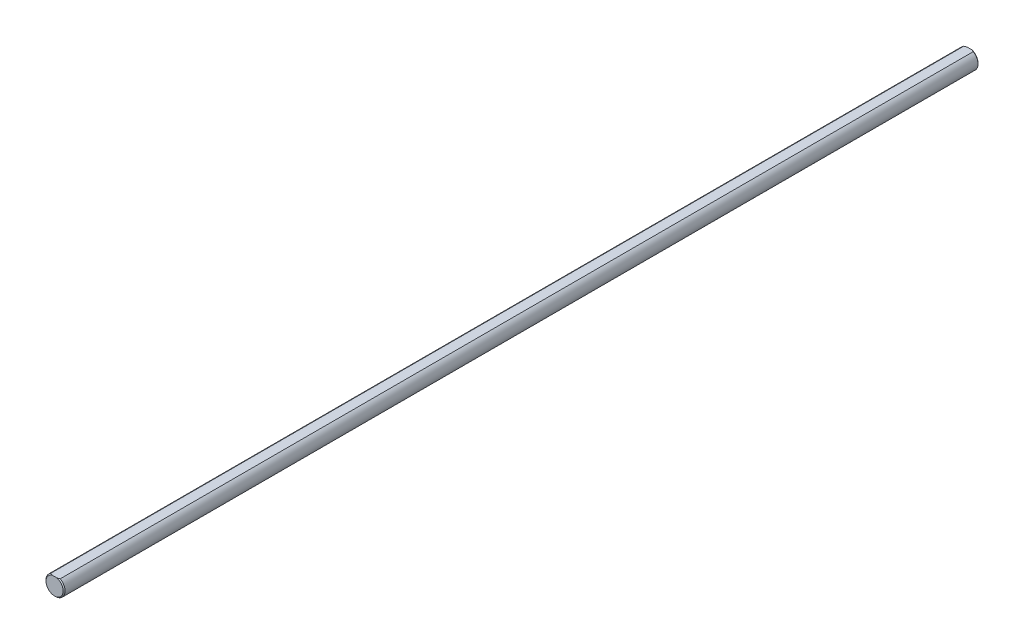
ISO-10303-21;
HEADER;
FILE_DESCRIPTION(('STEP AP214'),'2;1');
FILE_NAME('part.step','',(''),(''),'','','');
FILE_SCHEMA(('AUTOMOTIVE_DESIGN { 1 0 10303 214 1 1 1 1 }'));
ENDSEC;
DATA;
#1=APPLICATION_CONTEXT('core data for automotive mechanical design processes');
#2=APPLICATION_PROTOCOL_DEFINITION('international standard','automotive_design',2000,#1);
#3=PRODUCT_CONTEXT('',#1,'mechanical');
#4=PRODUCT('Part','Part','',(#3));
#5=PRODUCT_RELATED_PRODUCT_CATEGORY('part','',(#4));
#6=PRODUCT_DEFINITION_FORMATION('','',#4);
#7=PRODUCT_DEFINITION_CONTEXT('part definition',#1,'design');
#8=PRODUCT_DEFINITION('design','',#6,#7);
#9=PRODUCT_DEFINITION_SHAPE('','',#8);
#10=(LENGTH_UNIT() NAMED_UNIT(*) SI_UNIT(.MILLI.,.METRE.));
#11=(NAMED_UNIT(*) PLANE_ANGLE_UNIT() SI_UNIT($,.RADIAN.));
#12=(NAMED_UNIT(*) SI_UNIT($,.STERADIAN.) SOLID_ANGLE_UNIT());
#13=UNCERTAINTY_MEASURE_WITH_UNIT(LENGTH_MEASURE(1.E-05),#10,'distance_accuracy_value','');
#14=(GEOMETRIC_REPRESENTATION_CONTEXT(3) GLOBAL_UNCERTAINTY_ASSIGNED_CONTEXT((#13)) GLOBAL_UNIT_ASSIGNED_CONTEXT((#10,
#11,#12)) REPRESENTATION_CONTEXT('',''));
#15=CARTESIAN_POINT('',(0.,0.,0.));
#16=DIRECTION('',(0.,0.,1.));
#17=DIRECTION('',(1.,0.,0.));
#18=AXIS2_PLACEMENT_3D('',#15,#16,#17);
#19=CARTESIAN_POINT('',(0.,0.,152.4));
#20=DIRECTION('',(0.,0.,-1.));
#21=DIRECTION('',(-1.,0.,0.));
#22=AXIS2_PLACEMENT_3D('',#19,#20,#21);
#23=CYLINDRICAL_SURFACE('',#22,3.175);
#24=DIRECTION('',(0.,0.,1.));
#25=VECTOR('',#24,1.);
#26=CARTESIAN_POINT('',(-1.5875,2.74963065701559,-152.4));
#27=LINE('',#26,#25);
#28=CARTESIAN_POINT('',(-1.5875,2.74963065701559,-152.0825));
#29=VERTEX_POINT('',#28);
#30=CARTESIAN_POINT('',(-1.5875,2.74963065701559,152.0825));
#31=VERTEX_POINT('',#30);
#32=EDGE_CURVE('E81',#29,#31,#27,.T.);
#33=ORIENTED_EDGE('',*,*,#32,.F.);
#34=CARTESIAN_POINT('',(0.,0.,-152.0825));
#35=DIRECTION('',(0.,0.,1.));
#36=DIRECTION('',(1.,0.,0.));
#37=AXIS2_PLACEMENT_3D('',#34,#35,#36);
#38=CIRCLE('',#37,3.175);
#39=CARTESIAN_POINT('',(1.5875,2.74963065701559,-152.0825));
#40=VERTEX_POINT('',#39);
#41=EDGE_CURVE('E92',#29,#40,#38,.T.);
#42=ORIENTED_EDGE('',*,*,#41,.T.);
#43=DIRECTION('',(0.,0.,1.));
#44=VECTOR('',#43,1.);
#45=CARTESIAN_POINT('',(1.5875,2.74963065701559,-152.4));
#46=LINE('',#45,#44);
#47=CARTESIAN_POINT('',(1.5875,2.74963065701559,152.0825));
#48=VERTEX_POINT('',#47);
#49=EDGE_CURVE('E94',#40,#48,#46,.T.);
#50=ORIENTED_EDGE('',*,*,#49,.T.);
#51=CARTESIAN_POINT('',(0.,0.,152.0825));
#52=DIRECTION('',(0.,0.,1.));
#53=DIRECTION('',(1.,0.,0.));
#54=AXIS2_PLACEMENT_3D('',#51,#52,#53);
#55=CIRCLE('',#54,3.175);
#56=EDGE_CURVE('E93',#48,#31,#55,.F.);
#57=ORIENTED_EDGE('',*,*,#56,.T.);
#58=EDGE_LOOP('',(#33,#42,#50,#57));
#59=FACE_BOUND('',#58,.T.);
#60=ADVANCED_FACE('F34',(#59),#23,.T.);
#61=CARTESIAN_POINT('',(0.,0.,152.4));
#62=DIRECTION('',(0.,0.,1.));
#63=DIRECTION('',(1.,0.,0.));
#64=AXIS2_PLACEMENT_3D('',#61,#62,#63);
#65=PLANE('',#64);
#66=DIRECTION('',(1.,0.,0.));
#67=VECTOR('',#66,1.);
#68=CARTESIAN_POINT('',(-1.5875,2.74963065701559,152.4));
#69=LINE('',#68,#67);
#70=CARTESIAN_POINT('',(-0.777712993334318,2.74963065701559,152.4));
#71=VERTEX_POINT('',#70);
#72=CARTESIAN_POINT('',(0.777712993334318,2.74963065701559,152.4));
#73=VERTEX_POINT('',#72);
#74=EDGE_CURVE('E139',#71,#73,#69,.T.);
#75=ORIENTED_EDGE('',*,*,#74,.F.);
#76=CARTESIAN_POINT('',(0.,0.,152.4));
#77=DIRECTION('',(0.,0.,1.));
#78=DIRECTION('',(1.,0.,0.));
#79=AXIS2_PLACEMENT_3D('',#76,#77,#78);
#80=CIRCLE('',#79,2.85750000000018);
#81=EDGE_CURVE('E11',#71,#73,#80,.T.);
#82=ORIENTED_EDGE('',*,*,#81,.T.);
#83=EDGE_LOOP('',(#75,#82));
#84=FACE_BOUND('',#83,.T.);
#85=ADVANCED_FACE('F132',(#84),#65,.T.);
#86=CARTESIAN_POINT('',(0.,0.,-152.4));
#87=DIRECTION('',(0.,0.,1.));
#88=DIRECTION('',(1.,0.,0.));
#89=AXIS2_PLACEMENT_3D('',#86,#87,#88);
#90=PLANE('',#89);
#91=DIRECTION('',(1.,0.,0.));
#92=VECTOR('',#91,1.);
#93=CARTESIAN_POINT('',(-1.5875,2.74963065701559,-152.4));
#94=LINE('',#93,#92);
#95=CARTESIAN_POINT('',(-0.77771299333289,2.74963065701559,-152.4));
#96=VERTEX_POINT('',#95);
#97=CARTESIAN_POINT('',(0.77771299333289,2.74963065701559,-152.4));
#98=VERTEX_POINT('',#97);
#99=EDGE_CURVE('E83',#96,#98,#94,.T.);
#100=ORIENTED_EDGE('',*,*,#99,.T.);
#101=CARTESIAN_POINT('',(0.,0.,-152.4));
#102=DIRECTION('',(0.,0.,1.));
#103=DIRECTION('',(1.,0.,0.));
#104=AXIS2_PLACEMENT_3D('',#101,#102,#103);
#105=CIRCLE('',#104,2.85749999999979);
#106=EDGE_CURVE('E43',#98,#96,#105,.F.);
#107=ORIENTED_EDGE('',*,*,#106,.T.);
#108=EDGE_LOOP('',(#100,#107));
#109=FACE_BOUND('',#108,.T.);
#110=ADVANCED_FACE('F113',(#109),#90,.F.);
#111=CARTESIAN_POINT('',(-1.5875,2.74963065701559,-152.4));
#112=DIRECTION('',(0.,-1.,0.));
#113=DIRECTION('',(0.,0.,-1.));
#114=AXIS2_PLACEMENT_3D('',#111,#112,#113);
#115=PLANE('',#114);
#116=ORIENTED_EDGE('',*,*,#49,.F.);
#117=CARTESIAN_POINT('',(1.5875,2.74963065701559,-152.0825));
#118=CARTESIAN_POINT('',(1.52250516699264,2.74963065701559,-152.11498808248));
#119=CARTESIAN_POINT('',(1.45690188238018,2.74963065701559,-152.146301907619));
#120=CARTESIAN_POINT('',(1.32458227076998,2.74963065701559,-152.206025851425));
#121=CARTESIAN_POINT('',(1.25786903887703,2.74963065701559,-152.234442847017));
#122=CARTESIAN_POINT('',(1.12308918002454,2.74963065701559,-152.287992005704));
#123=CARTESIAN_POINT('',(1.05502199036127,2.74963065701559,-152.313122768734));
#124=CARTESIAN_POINT('',(0.917422256787349,2.74963065701559,-152.359582195948));
#125=CARTESIAN_POINT('',(0.847886543274815,2.74963065701559,-152.380901435531));
#126=CARTESIAN_POINT('',(0.777712993332883,2.74963065701559,-152.4));
#127=B_SPLINE_CURVE_WITH_KNOTS('',3,(#117,#118,#119,#120,#121,#122,#123,#124,#125,#126),
.UNSPECIFIED.,.F.,.F.,(4,2,2,2,4),(0.,0.218002568777972,0.435474929897561,0.653039643131156,
0.871135095681379),.UNSPECIFIED.);
#128=EDGE_CURVE('E87',#40,#98,#127,.T.);
#129=ORIENTED_EDGE('',*,*,#128,.T.);
#130=ORIENTED_EDGE('',*,*,#99,.F.);
#131=CARTESIAN_POINT('',(-0.77771299333289,2.74963065701559,-152.4));
#132=CARTESIAN_POINT('',(-0.847886543274821,2.74963065701559,-152.380901435531));
#133=CARTESIAN_POINT('',(-0.917422256787353,2.74963065701559,-152.359582195948));
#134=CARTESIAN_POINT('',(-1.05502199036128,2.74963065701559,-152.313122768734));
#135=CARTESIAN_POINT('',(-1.12308918002455,2.74963065701559,-152.287992005704));
#136=CARTESIAN_POINT('',(-1.25786903887703,2.74963065701559,-152.234442847017));
#137=CARTESIAN_POINT('',(-1.32458227076998,2.74963065701559,-152.206025851425));
#138=CARTESIAN_POINT('',(-1.45690188238017,2.74963065701559,-152.146301907619));
#139=CARTESIAN_POINT('',(-1.52250516699263,2.74963065701559,-152.11498808248));
#140=CARTESIAN_POINT('',(-1.5875,2.74963065701559,-152.0825));
#141=B_SPLINE_CURVE_WITH_KNOTS('',3,(#131,#132,#133,#134,#135,#136,#137,#138,#139,#140),
.UNSPECIFIED.,.F.,.F.,(4,2,2,2,4),(0.,0.21809545255022,0.435660165783814,0.653132526903393,
0.871135095681371),.UNSPECIFIED.);
#142=EDGE_CURVE('E77',#96,#29,#141,.T.);
#143=ORIENTED_EDGE('',*,*,#142,.T.);
#144=ORIENTED_EDGE('',*,*,#32,.T.);
#145=CARTESIAN_POINT('',(-1.5875,2.74963065701559,152.0825));
#146=CARTESIAN_POINT('',(-1.52250516699275,2.74963065701559,152.11498808248));
#147=CARTESIAN_POINT('',(-1.4569018823804,2.74963065701559,152.14630190762));
#148=CARTESIAN_POINT('',(-1.32458227077043,2.74963065701559,152.206025851425));
#149=CARTESIAN_POINT('',(-1.25786903887759,2.74963065701559,152.234442847017));
#150=CARTESIAN_POINT('',(-1.12308918002534,2.74963065701559,152.287992005704));
#151=CARTESIAN_POINT('',(-1.0550219903622,2.74963065701559,152.313122768734));
#152=CARTESIAN_POINT('',(-0.917422256788531,2.74963065701559,152.359582195948));
#153=CARTESIAN_POINT('',(-0.84788654327613,2.74963065701559,152.380901435531));
#154=CARTESIAN_POINT('',(-0.777712993334327,2.74963065701559,152.4));
#155=B_SPLINE_CURVE_WITH_KNOTS('',3,(#145,#146,#147,#148,#149,#150,#151,#152,#153,#154),
.UNSPECIFIED.,.F.,.F.,(4,2,2,2,4),(0.,0.218002568777616,0.435474929896812,0.653039643130032,
0.871135095679873),.UNSPECIFIED.);
#156=EDGE_CURVE('E57',#31,#71,#155,.T.);
#157=ORIENTED_EDGE('',*,*,#156,.T.);
#158=ORIENTED_EDGE('',*,*,#74,.T.);
#159=CARTESIAN_POINT('',(0.777712993334318,2.74963065701559,152.4));
#160=CARTESIAN_POINT('',(0.847886543276122,2.74963065701559,152.380901435531));
#161=CARTESIAN_POINT('',(0.917422256788525,2.74963065701559,152.359582195948));
#162=CARTESIAN_POINT('',(1.05502199036219,2.74963065701559,152.313122768734));
#163=CARTESIAN_POINT('',(1.12308918002534,2.74963065701559,152.287992005704));
#164=CARTESIAN_POINT('',(1.25786903887759,2.74963065701559,152.234442847017));
#165=CARTESIAN_POINT('',(1.32458227077043,2.74963065701559,152.206025851425));
#166=CARTESIAN_POINT('',(1.4569018823804,2.74963065701559,152.14630190762));
#167=CARTESIAN_POINT('',(1.52250516699275,2.74963065701559,152.11498808248));
#168=CARTESIAN_POINT('',(1.5875,2.74963065701559,152.0825));
#169=B_SPLINE_CURVE_WITH_KNOTS('',3,(#159,#160,#161,#162,#163,#164,#165,#166,#167,#168),
.UNSPECIFIED.,.F.,.F.,(4,2,2,2,4),(0.,0.218095452549845,0.435660165783067,0.653132526902265,
0.871135095679883),.UNSPECIFIED.);
#170=EDGE_CURVE('E50',#73,#48,#169,.T.);
#171=ORIENTED_EDGE('',*,*,#170,.T.);
#172=EDGE_LOOP('',(#116,#129,#130,#143,#144,#157,#158,#171));
#173=FACE_BOUND('',#172,.T.);
#174=ADVANCED_FACE('F80',(#173),#115,.F.);
#175=CARTESIAN_POINT('',(0.,0.,-152.0825));
#176=DIRECTION('',(0.,0.,1.));
#177=DIRECTION('',(1.,0.,0.));
#178=AXIS2_PLACEMENT_3D('',#175,#176,#177);
#179=CONICAL_SURFACE('',#178,3.175,0.785398163397388);
#180=ORIENTED_EDGE('',*,*,#142,.F.);
#181=ORIENTED_EDGE('',*,*,#106,.F.);
#182=ORIENTED_EDGE('',*,*,#128,.F.);
#183=ORIENTED_EDGE('',*,*,#41,.F.);
#184=EDGE_LOOP('',(#180,#181,#182,#183));
#185=FACE_BOUND('',#184,.T.);
#186=ADVANCED_FACE('F96',(#185),#179,.T.);
#187=CARTESIAN_POINT('',(0.,0.,152.4));
#188=DIRECTION('',(0.,0.,-1.));
#189=DIRECTION('',(-1.,0.,0.));
#190=AXIS2_PLACEMENT_3D('',#187,#188,#189);
#191=CONICAL_SURFACE('',#190,2.85750000000018,0.785398163397431);
#192=ORIENTED_EDGE('',*,*,#156,.F.);
#193=ORIENTED_EDGE('',*,*,#56,.F.);
#194=ORIENTED_EDGE('',*,*,#170,.F.);
#195=ORIENTED_EDGE('',*,*,#81,.F.);
#196=EDGE_LOOP('',(#192,#193,#194,#195));
#197=FACE_BOUND('',#196,.T.);
#198=ADVANCED_FACE('F36',(#197),#191,.T.);
#199=CLOSED_SHELL('',(#60,#85,#110,#174,#186,#198));
#200=MANIFOLD_SOLID_BREP('B2',#199);
#201=ADVANCED_BREP_SHAPE_REPRESENTATION('',(#18,#200),#14);
#202=SHAPE_DEFINITION_REPRESENTATION(#9,#201);
ENDSEC;
END-ISO-10303-21;
